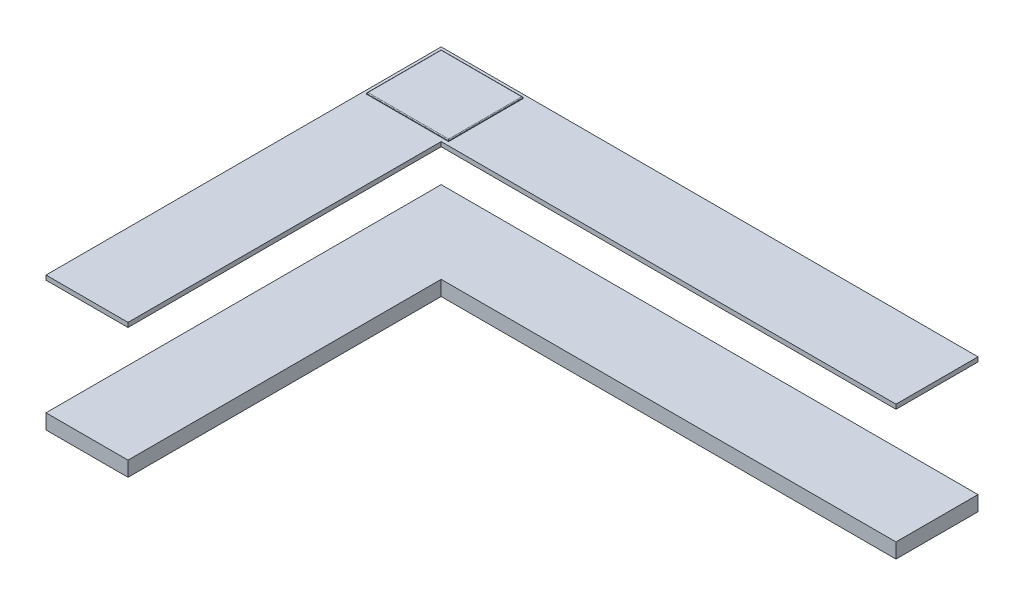
ISO-10303-21;
HEADER;
FILE_DESCRIPTION(('STEP AP214'),'2;1');
FILE_NAME('part.step','',(''),(''),'','','');
FILE_SCHEMA(('AUTOMOTIVE_DESIGN { 1 0 10303 214 1 1 1 1 }'));
ENDSEC;
DATA;
#1=APPLICATION_CONTEXT('core data for automotive mechanical design processes');
#2=APPLICATION_PROTOCOL_DEFINITION('international standard','automotive_design',2000,#1);
#3=PRODUCT_CONTEXT('',#1,'mechanical');
#4=PRODUCT('Part','Part','',(#3));
#5=PRODUCT_RELATED_PRODUCT_CATEGORY('part','',(#4));
#6=PRODUCT_DEFINITION_FORMATION('','',#4);
#7=PRODUCT_DEFINITION_CONTEXT('part definition',#1,'design');
#8=PRODUCT_DEFINITION('design','',#6,#7);
#9=PRODUCT_DEFINITION_SHAPE('','',#8);
#10=(LENGTH_UNIT() NAMED_UNIT(*) SI_UNIT(.MILLI.,.METRE.));
#11=(NAMED_UNIT(*) PLANE_ANGLE_UNIT() SI_UNIT($,.RADIAN.));
#12=(NAMED_UNIT(*) SI_UNIT($,.STERADIAN.) SOLID_ANGLE_UNIT());
#13=UNCERTAINTY_MEASURE_WITH_UNIT(LENGTH_MEASURE(1.E-05),#10,'distance_accuracy_value','');
#14=(GEOMETRIC_REPRESENTATION_CONTEXT(3) GLOBAL_UNCERTAINTY_ASSIGNED_CONTEXT((#13)) GLOBAL_UNIT_ASSIGNED_CONTEXT((#10,
#11,#12)) REPRESENTATION_CONTEXT('',''));
#15=CARTESIAN_POINT('',(0.,0.,0.));
#16=DIRECTION('',(0.,0.,1.));
#17=DIRECTION('',(1.,0.,0.));
#18=AXIS2_PLACEMENT_3D('',#15,#16,#17);
#19=CARTESIAN_POINT('',(0.,900.,0.));
#20=DIRECTION('',(0.,1.,0.));
#21=DIRECTION('',(0.,0.,1.));
#22=AXIS2_PLACEMENT_3D('',#19,#20,#21);
#23=PLANE('',#22);
#24=DIRECTION('',(0.,0.,-1.));
#25=VECTOR('',#24,1.);
#26=CARTESIAN_POINT('',(-911.305732484077,900.,1241.12247402156));
#27=LINE('',#26,#25);
#28=CARTESIAN_POINT('',(-911.305732484077,900.,1242.12247402156));
#29=VERTEX_POINT('',#28);
#30=CARTESIAN_POINT('',(-911.305732484077,900.,1241.12247402156));
#31=VERTEX_POINT('',#30);
#32=EDGE_CURVE('E230',#29,#31,#27,.T.);
#33=ORIENTED_EDGE('',*,*,#32,.F.);
#34=DIRECTION('',(1.,0.,0.));
#35=VECTOR('',#34,1.);
#36=CARTESIAN_POINT('',(-911.305732484077,900.,1242.12247402156));
#37=LINE('',#36,#35);
#38=CARTESIAN_POINT('',(-912.305732484077,900.,1242.12247402156));
#39=VERTEX_POINT('',#38);
#40=EDGE_CURVE('E220',#39,#29,#37,.T.);
#41=ORIENTED_EDGE('',*,*,#40,.F.);
#42=DIRECTION('',(0.,0.,1.));
#43=VECTOR('',#42,1.);
#44=CARTESIAN_POINT('',(-912.305732484077,900.,1241.12247402156));
#45=LINE('',#44,#43);
#46=CARTESIAN_POINT('',(-912.305732484077,900.,1241.12247402156));
#47=VERTEX_POINT('',#46);
#48=EDGE_CURVE('E236',#47,#39,#45,.T.);
#49=ORIENTED_EDGE('',*,*,#48,.F.);
#50=DIRECTION('',(-1.,0.,0.));
#51=VECTOR('',#50,1.);
#52=CARTESIAN_POINT('',(-911.305732484077,900.,1241.12247402156));
#53=LINE('',#52,#51);
#54=EDGE_CURVE('E232',#31,#47,#53,.T.);
#55=ORIENTED_EDGE('',*,*,#54,.F.);
#56=EDGE_LOOP('',(#33,#41,#49,#55));
#57=FACE_BOUND('',#56,.T.);
#58=DIRECTION('',(0.,0.,-1.));
#59=VECTOR('',#58,1.);
#60=CARTESIAN_POINT('',(1763.69426751592,900.,-383.877525978437));
#61=LINE('',#60,#59);
#62=CARTESIAN_POINT('',(1763.69426751592,900.,-382.877525978437));
#63=VERTEX_POINT('',#62);
#64=CARTESIAN_POINT('',(1763.69426751592,900.,-383.877525978437));
#65=VERTEX_POINT('',#64);
#66=EDGE_CURVE('E233',#63,#65,#61,.T.);
#67=ORIENTED_EDGE('',*,*,#66,.F.);
#68=DIRECTION('',(1.,0.,0.));
#69=VECTOR('',#68,1.);
#70=CARTESIAN_POINT('',(1763.69426751592,900.,-382.877525978437));
#71=LINE('',#70,#69);
#72=CARTESIAN_POINT('',(1762.69426751592,900.,-382.877525978437));
#73=VERTEX_POINT('',#72);
#74=EDGE_CURVE('E259',#73,#63,#71,.T.);
#75=ORIENTED_EDGE('',*,*,#74,.F.);
#76=DIRECTION('',(0.,0.,1.));
#77=VECTOR('',#76,1.);
#78=CARTESIAN_POINT('',(1762.69426751592,900.,-383.877525978437));
#79=LINE('',#78,#77);
#80=CARTESIAN_POINT('',(1762.69426751592,900.,-383.877525978437));
#81=VERTEX_POINT('',#80);
#82=EDGE_CURVE('E262',#81,#73,#79,.T.);
#83=ORIENTED_EDGE('',*,*,#82,.F.);
#84=DIRECTION('',(-1.,0.,0.));
#85=VECTOR('',#84,1.);
#86=CARTESIAN_POINT('',(1763.69426751592,900.,-383.877525978437));
#87=LINE('',#86,#85);
#88=EDGE_CURVE('E266',#65,#81,#87,.T.);
#89=ORIENTED_EDGE('',*,*,#88,.F.);
#90=EDGE_LOOP('',(#67,#75,#83,#89));
#91=FACE_BOUND('',#90,.T.);
#92=DIRECTION('',(1.,0.,0.));
#93=VECTOR('',#92,1.);
#94=CARTESIAN_POINT('',(2163.69426751592,900.,-357.877525978438));
#95=LINE('',#94,#93);
#96=CARTESIAN_POINT('',(-886.305732484077,900.,-357.877525978437));
#97=VERTEX_POINT('',#96);
#98=CARTESIAN_POINT('',(2163.69426751592,900.,-357.877525978438));
#99=VERTEX_POINT('',#98);
#100=EDGE_CURVE('E280',#97,#99,#95,.T.);
#101=ORIENTED_EDGE('',*,*,#100,.T.);
#102=DIRECTION('',(0.,0.,-1.));
#103=VECTOR('',#102,1.);
#104=CARTESIAN_POINT('',(2163.69426751592,900.,-907.877525978437));
#105=LINE('',#104,#103);
#106=CARTESIAN_POINT('',(2163.69426751592,900.,-907.877525978437));
#107=VERTEX_POINT('',#106);
#108=EDGE_CURVE('E283',#99,#107,#105,.T.);
#109=ORIENTED_EDGE('',*,*,#108,.T.);
#110=DIRECTION('',(-1.,0.,0.));
#111=VECTOR('',#110,1.);
#112=CARTESIAN_POINT('',(-1436.30573248408,900.,-907.877525978437));
#113=LINE('',#112,#111);
#114=CARTESIAN_POINT('',(-1436.30573248408,900.,-907.877525978437));
#115=VERTEX_POINT('',#114);
#116=EDGE_CURVE('E286',#107,#115,#113,.T.);
#117=ORIENTED_EDGE('',*,*,#116,.T.);
#118=DIRECTION('',(0.,0.,1.));
#119=VECTOR('',#118,1.);
#120=CARTESIAN_POINT('',(-1436.30573248408,900.,1742.12247402156));
#121=LINE('',#120,#119);
#122=CARTESIAN_POINT('',(-1436.30573248408,900.,1742.12247402156));
#123=VERTEX_POINT('',#122);
#124=EDGE_CURVE('E288',#115,#123,#121,.T.);
#125=ORIENTED_EDGE('',*,*,#124,.T.);
#126=DIRECTION('',(1.,0.,0.));
#127=VECTOR('',#126,1.);
#128=CARTESIAN_POINT('',(-886.305732484077,900.,1742.12247402156));
#129=LINE('',#128,#127);
#130=CARTESIAN_POINT('',(-886.305732484077,900.,1742.12247402156));
#131=VERTEX_POINT('',#130);
#132=EDGE_CURVE('E290',#123,#131,#129,.T.);
#133=ORIENTED_EDGE('',*,*,#132,.T.);
#134=DIRECTION('',(0.,0.,-1.));
#135=VECTOR('',#134,1.);
#136=CARTESIAN_POINT('',(-886.305732484077,900.,-357.877525978437));
#137=LINE('',#136,#135);
#138=EDGE_CURVE('E292',#131,#97,#137,.T.);
#139=ORIENTED_EDGE('',*,*,#138,.T.);
#140=EDGE_LOOP('',(#101,#109,#117,#125,#133,#139));
#141=FACE_BOUND('',#140,.T.);
#142=DIRECTION('',(1.,0.,0.));
#143=VECTOR('',#142,1.);
#144=CARTESIAN_POINT('',(-1411.30573248408,900.,-382.877525978438));
#145=LINE('',#144,#143);
#146=CARTESIAN_POINT('',(-1411.30573248408,900.,-382.877525978438));
#147=VERTEX_POINT('',#146);
#148=CARTESIAN_POINT('',(-861.305732484078,900.,-382.877525978438));
#149=VERTEX_POINT('',#148);
#150=EDGE_CURVE('E189',#147,#149,#145,.T.);
#151=ORIENTED_EDGE('',*,*,#150,.F.);
#152=DIRECTION('',(0.,0.,1.));
#153=VECTOR('',#152,1.);
#154=CARTESIAN_POINT('',(-1411.30573248408,900.,-882.877525978437));
#155=LINE('',#154,#153);
#156=CARTESIAN_POINT('',(-1411.30573248408,900.,-882.877525978437));
#157=VERTEX_POINT('',#156);
#158=EDGE_CURVE('E197',#157,#147,#155,.T.);
#159=ORIENTED_EDGE('',*,*,#158,.F.);
#160=DIRECTION('',(-1.,0.,0.));
#161=VECTOR('',#160,1.);
#162=CARTESIAN_POINT('',(-1411.30573248408,900.,-882.877525978437));
#163=LINE('',#162,#161);
#164=CARTESIAN_POINT('',(-861.305732484078,900.,-882.877525978437));
#165=VERTEX_POINT('',#164);
#166=EDGE_CURVE('E208',#165,#157,#163,.T.);
#167=ORIENTED_EDGE('',*,*,#166,.F.);
#168=DIRECTION('',(0.,0.,-1.));
#169=VECTOR('',#168,1.);
#170=CARTESIAN_POINT('',(-861.305732484078,900.,-882.877525978437));
#171=LINE('',#170,#169);
#172=EDGE_CURVE('E206',#149,#165,#171,.T.);
#173=ORIENTED_EDGE('',*,*,#172,.F.);
#174=EDGE_LOOP('',(#151,#159,#167,#173));
#175=FACE_BOUND('',#174,.T.);
#176=ADVANCED_FACE('F49',(#57,#91,#141,#175),#23,.T.);
#177=CARTESIAN_POINT('',(2163.69426751592,900.,-357.877525978438));
#178=DIRECTION('',(0.,0.,-1.));
#179=DIRECTION('',(-1.,0.,0.));
#180=AXIS2_PLACEMENT_3D('',#177,#178,#179);
#181=PLANE('',#180);
#182=DIRECTION('',(1.,0.,0.));
#183=VECTOR('',#182,1.);
#184=CARTESIAN_POINT('',(2163.69426751592,870.,-357.877525978438));
#185=LINE('',#184,#183);
#186=CARTESIAN_POINT('',(-886.305732484077,870.,-357.877525978437));
#187=VERTEX_POINT('',#186);
#188=CARTESIAN_POINT('',(2163.69426751592,870.,-357.877525978438));
#189=VERTEX_POINT('',#188);
#190=EDGE_CURVE('E243',#187,#189,#185,.T.);
#191=ORIENTED_EDGE('',*,*,#190,.T.);
#192=DIRECTION('',(0.,-1.,0.));
#193=VECTOR('',#192,1.);
#194=CARTESIAN_POINT('',(2163.69426751592,900.,-357.877525978438));
#195=LINE('',#194,#193);
#196=EDGE_CURVE('E320',#99,#189,#195,.T.);
#197=ORIENTED_EDGE('',*,*,#196,.F.);
#198=ORIENTED_EDGE('',*,*,#100,.F.);
#199=DIRECTION('',(0.,-1.,0.));
#200=VECTOR('',#199,1.);
#201=CARTESIAN_POINT('',(-886.305732484077,900.,-357.877525978437));
#202=LINE('',#201,#200);
#203=EDGE_CURVE('E294',#97,#187,#202,.T.);
#204=ORIENTED_EDGE('',*,*,#203,.T.);
#205=EDGE_LOOP('',(#191,#197,#198,#204));
#206=FACE_BOUND('',#205,.T.);
#207=ADVANCED_FACE('F372',(#206),#181,.F.);
#208=CARTESIAN_POINT('',(2163.69426751592,900.,-907.877525978437));
#209=DIRECTION('',(-1.,0.,0.));
#210=DIRECTION('',(0.,0.,1.));
#211=AXIS2_PLACEMENT_3D('',#208,#209,#210);
#212=PLANE('',#211);
#213=DIRECTION('',(0.,0.,-1.));
#214=VECTOR('',#213,1.);
#215=CARTESIAN_POINT('',(2163.69426751592,870.,-907.877525978437));
#216=LINE('',#215,#214);
#217=CARTESIAN_POINT('',(2163.69426751592,870.,-907.877525978437));
#218=VERTEX_POINT('',#217);
#219=EDGE_CURVE('E297',#189,#218,#216,.T.);
#220=ORIENTED_EDGE('',*,*,#219,.T.);
#221=DIRECTION('',(0.,-1.,0.));
#222=VECTOR('',#221,1.);
#223=CARTESIAN_POINT('',(2163.69426751592,900.,-907.877525978437));
#224=LINE('',#223,#222);
#225=EDGE_CURVE('E317',#107,#218,#224,.T.);
#226=ORIENTED_EDGE('',*,*,#225,.F.);
#227=ORIENTED_EDGE('',*,*,#108,.F.);
#228=ORIENTED_EDGE('',*,*,#196,.T.);
#229=EDGE_LOOP('',(#220,#226,#227,#228));
#230=FACE_BOUND('',#229,.T.);
#231=ADVANCED_FACE('F378',(#230),#212,.F.);
#232=CARTESIAN_POINT('',(-1436.30573248408,900.,-907.877525978437));
#233=DIRECTION('',(0.,0.,1.));
#234=DIRECTION('',(1.,0.,0.));
#235=AXIS2_PLACEMENT_3D('',#232,#233,#234);
#236=PLANE('',#235);
#237=DIRECTION('',(-1.,0.,0.));
#238=VECTOR('',#237,1.);
#239=CARTESIAN_POINT('',(-1436.30573248408,870.,-907.877525978437));
#240=LINE('',#239,#238);
#241=CARTESIAN_POINT('',(-1436.30573248408,870.,-907.877525978437));
#242=VERTEX_POINT('',#241);
#243=EDGE_CURVE('E299',#218,#242,#240,.T.);
#244=ORIENTED_EDGE('',*,*,#243,.T.);
#245=DIRECTION('',(0.,-1.,0.));
#246=VECTOR('',#245,1.);
#247=CARTESIAN_POINT('',(-1436.30573248408,900.,-907.877525978437));
#248=LINE('',#247,#246);
#249=EDGE_CURVE('E314',#115,#242,#248,.T.);
#250=ORIENTED_EDGE('',*,*,#249,.F.);
#251=ORIENTED_EDGE('',*,*,#116,.F.);
#252=ORIENTED_EDGE('',*,*,#225,.T.);
#253=EDGE_LOOP('',(#244,#250,#251,#252));
#254=FACE_BOUND('',#253,.T.);
#255=ADVANCED_FACE('F403',(#254),#236,.F.);
#256=CARTESIAN_POINT('',(-1436.30573248408,900.,1742.12247402156));
#257=DIRECTION('',(1.,0.,0.));
#258=DIRECTION('',(0.,0.,-1.));
#259=AXIS2_PLACEMENT_3D('',#256,#257,#258);
#260=PLANE('',#259);
#261=DIRECTION('',(0.,0.,1.));
#262=VECTOR('',#261,1.);
#263=CARTESIAN_POINT('',(-1436.30573248408,870.,1742.12247402156));
#264=LINE('',#263,#262);
#265=CARTESIAN_POINT('',(-1436.30573248408,870.,1742.12247402156));
#266=VERTEX_POINT('',#265);
#267=EDGE_CURVE('E301',#242,#266,#264,.T.);
#268=ORIENTED_EDGE('',*,*,#267,.T.);
#269=DIRECTION('',(0.,-1.,0.));
#270=VECTOR('',#269,1.);
#271=CARTESIAN_POINT('',(-1436.30573248408,900.,1742.12247402156));
#272=LINE('',#271,#270);
#273=EDGE_CURVE('E311',#123,#266,#272,.T.);
#274=ORIENTED_EDGE('',*,*,#273,.F.);
#275=ORIENTED_EDGE('',*,*,#124,.F.);
#276=ORIENTED_EDGE('',*,*,#249,.T.);
#277=EDGE_LOOP('',(#268,#274,#275,#276));
#278=FACE_BOUND('',#277,.T.);
#279=ADVANCED_FACE('F399',(#278),#260,.F.);
#280=CARTESIAN_POINT('',(-886.305732484077,900.,1742.12247402156));
#281=DIRECTION('',(0.,0.,-1.));
#282=DIRECTION('',(-1.,0.,0.));
#283=AXIS2_PLACEMENT_3D('',#280,#281,#282);
#284=PLANE('',#283);
#285=DIRECTION('',(1.,0.,0.));
#286=VECTOR('',#285,1.);
#287=CARTESIAN_POINT('',(-886.305732484077,870.,1742.12247402156));
#288=LINE('',#287,#286);
#289=CARTESIAN_POINT('',(-886.305732484077,870.,1742.12247402156));
#290=VERTEX_POINT('',#289);
#291=EDGE_CURVE('E303',#266,#290,#288,.T.);
#292=ORIENTED_EDGE('',*,*,#291,.T.);
#293=DIRECTION('',(0.,-1.,0.));
#294=VECTOR('',#293,1.);
#295=CARTESIAN_POINT('',(-886.305732484077,900.,1742.12247402156));
#296=LINE('',#295,#294);
#297=EDGE_CURVE('E308',#131,#290,#296,.T.);
#298=ORIENTED_EDGE('',*,*,#297,.F.);
#299=ORIENTED_EDGE('',*,*,#132,.F.);
#300=ORIENTED_EDGE('',*,*,#273,.T.);
#301=EDGE_LOOP('',(#292,#298,#299,#300));
#302=FACE_BOUND('',#301,.T.);
#303=ADVANCED_FACE('F395',(#302),#284,.F.);
#304=CARTESIAN_POINT('',(-886.305732484077,900.,-357.877525978437));
#305=DIRECTION('',(-1.,0.,0.));
#306=DIRECTION('',(0.,0.,1.));
#307=AXIS2_PLACEMENT_3D('',#304,#305,#306);
#308=PLANE('',#307);
#309=DIRECTION('',(0.,0.,-1.));
#310=VECTOR('',#309,1.);
#311=CARTESIAN_POINT('',(-886.305732484077,870.,-357.877525978437));
#312=LINE('',#311,#310);
#313=EDGE_CURVE('E284',#290,#187,#312,.T.);
#314=ORIENTED_EDGE('',*,*,#313,.T.);
#315=ORIENTED_EDGE('',*,*,#203,.F.);
#316=ORIENTED_EDGE('',*,*,#138,.F.);
#317=ORIENTED_EDGE('',*,*,#297,.T.);
#318=EDGE_LOOP('',(#314,#315,#316,#317));
#319=FACE_BOUND('',#318,.T.);
#320=ADVANCED_FACE('F391',(#319),#308,.F.);
#321=CARTESIAN_POINT('',(0.,870.,0.));
#322=DIRECTION('',(0.,1.,0.));
#323=DIRECTION('',(0.,0.,1.));
#324=AXIS2_PLACEMENT_3D('',#321,#322,#323);
#325=PLANE('',#324);
#326=DIRECTION('',(1.,0.,0.));
#327=VECTOR('',#326,1.);
#328=CARTESIAN_POINT('',(-911.305732484077,870.,1242.12247402156));
#329=LINE('',#328,#327);
#330=CARTESIAN_POINT('',(-912.305732484077,870.,1242.12247402156));
#331=VERTEX_POINT('',#330);
#332=CARTESIAN_POINT('',(-911.305732484077,870.,1242.12247402156));
#333=VERTEX_POINT('',#332);
#334=EDGE_CURVE('E226',#331,#333,#329,.T.);
#335=ORIENTED_EDGE('',*,*,#334,.T.);
#336=DIRECTION('',(0.,0.,-1.));
#337=VECTOR('',#336,1.);
#338=CARTESIAN_POINT('',(-911.305732484077,870.,1241.12247402156));
#339=LINE('',#338,#337);
#340=CARTESIAN_POINT('',(-911.305732484077,870.,1241.12247402156));
#341=VERTEX_POINT('',#340);
#342=EDGE_CURVE('E216',#333,#341,#339,.T.);
#343=ORIENTED_EDGE('',*,*,#342,.T.);
#344=DIRECTION('',(-1.,0.,0.));
#345=VECTOR('',#344,1.);
#346=CARTESIAN_POINT('',(-911.305732484077,870.,1241.12247402156));
#347=LINE('',#346,#345);
#348=CARTESIAN_POINT('',(-912.305732484077,870.,1241.12247402156));
#349=VERTEX_POINT('',#348);
#350=EDGE_CURVE('E219',#341,#349,#347,.T.);
#351=ORIENTED_EDGE('',*,*,#350,.T.);
#352=DIRECTION('',(0.,0.,1.));
#353=VECTOR('',#352,1.);
#354=CARTESIAN_POINT('',(-912.305732484077,870.,1241.12247402156));
#355=LINE('',#354,#353);
#356=EDGE_CURVE('E223',#349,#331,#355,.T.);
#357=ORIENTED_EDGE('',*,*,#356,.T.);
#358=EDGE_LOOP('',(#335,#343,#351,#357));
#359=FACE_BOUND('',#358,.T.);
#360=DIRECTION('',(1.,0.,0.));
#361=VECTOR('',#360,1.);
#362=CARTESIAN_POINT('',(1763.69426751592,870.,-382.877525978437));
#363=LINE('',#362,#361);
#364=CARTESIAN_POINT('',(1762.69426751592,870.,-382.877525978437));
#365=VERTEX_POINT('',#364);
#366=CARTESIAN_POINT('',(1763.69426751592,870.,-382.877525978437));
#367=VERTEX_POINT('',#366);
#368=EDGE_CURVE('E253',#365,#367,#363,.T.);
#369=ORIENTED_EDGE('',*,*,#368,.T.);
#370=DIRECTION('',(0.,0.,-1.));
#371=VECTOR('',#370,1.);
#372=CARTESIAN_POINT('',(1763.69426751592,870.,-383.877525978437));
#373=LINE('',#372,#371);
#374=CARTESIAN_POINT('',(1763.69426751592,870.,-383.877525978437));
#375=VERTEX_POINT('',#374);
#376=EDGE_CURVE('E263',#367,#375,#373,.T.);
#377=ORIENTED_EDGE('',*,*,#376,.T.);
#378=DIRECTION('',(-1.,0.,0.));
#379=VECTOR('',#378,1.);
#380=CARTESIAN_POINT('',(1763.69426751592,870.,-383.877525978437));
#381=LINE('',#380,#379);
#382=CARTESIAN_POINT('',(1762.69426751592,870.,-383.877525978437));
#383=VERTEX_POINT('',#382);
#384=EDGE_CURVE('E275',#375,#383,#381,.T.);
#385=ORIENTED_EDGE('',*,*,#384,.T.);
#386=DIRECTION('',(0.,0.,1.));
#387=VECTOR('',#386,1.);
#388=CARTESIAN_POINT('',(1762.69426751592,870.,-383.877525978437));
#389=LINE('',#388,#387);
#390=EDGE_CURVE('E272',#383,#365,#389,.T.);
#391=ORIENTED_EDGE('',*,*,#390,.T.);
#392=EDGE_LOOP('',(#369,#377,#385,#391));
#393=FACE_BOUND('',#392,.T.);
#394=ORIENTED_EDGE('',*,*,#190,.F.);
#395=ORIENTED_EDGE('',*,*,#313,.F.);
#396=ORIENTED_EDGE('',*,*,#291,.F.);
#397=ORIENTED_EDGE('',*,*,#267,.F.);
#398=ORIENTED_EDGE('',*,*,#243,.F.);
#399=ORIENTED_EDGE('',*,*,#219,.F.);
#400=EDGE_LOOP('',(#394,#395,#396,#397,#398,#399));
#401=FACE_BOUND('',#400,.T.);
#402=ADVANCED_FACE('F387',(#359,#393,#401),#325,.F.);
#403=CARTESIAN_POINT('',(1763.69426751592,870.,-383.877525978437));
#404=DIRECTION('',(1.,0.,0.));
#405=DIRECTION('',(0.,0.,-1.));
#406=AXIS2_PLACEMENT_3D('',#403,#404,#405);
#407=PLANE('',#406);
#408=ORIENTED_EDGE('',*,*,#66,.T.);
#409=DIRECTION('',(0.,1.,0.));
#410=VECTOR('',#409,1.);
#411=CARTESIAN_POINT('',(1763.69426751592,870.,-383.877525978437));
#412=LINE('',#411,#410);
#413=EDGE_CURVE('E250',#375,#65,#412,.T.);
#414=ORIENTED_EDGE('',*,*,#413,.F.);
#415=ORIENTED_EDGE('',*,*,#376,.F.);
#416=DIRECTION('',(0.,1.,0.));
#417=VECTOR('',#416,1.);
#418=CARTESIAN_POINT('',(1763.69426751592,870.,-382.877525978437));
#419=LINE('',#418,#417);
#420=EDGE_CURVE('E193',#367,#63,#419,.T.);
#421=ORIENTED_EDGE('',*,*,#420,.T.);
#422=EDGE_LOOP('',(#408,#414,#415,#421));
#423=FACE_BOUND('',#422,.T.);
#424=ADVANCED_FACE('F390',(#423),#407,.F.);
#425=CARTESIAN_POINT('',(1763.69426751592,870.,-382.877525978437));
#426=DIRECTION('',(0.,0.,1.));
#427=DIRECTION('',(1.,0.,0.));
#428=AXIS2_PLACEMENT_3D('',#425,#426,#427);
#429=PLANE('',#428);
#430=ORIENTED_EDGE('',*,*,#74,.T.);
#431=ORIENTED_EDGE('',*,*,#420,.F.);
#432=ORIENTED_EDGE('',*,*,#368,.F.);
#433=DIRECTION('',(0.,1.,0.));
#434=VECTOR('',#433,1.);
#435=CARTESIAN_POINT('',(1762.69426751592,870.,-382.877525978437));
#436=LINE('',#435,#434);
#437=EDGE_CURVE('E256',#365,#73,#436,.T.);
#438=ORIENTED_EDGE('',*,*,#437,.T.);
#439=EDGE_LOOP('',(#430,#431,#432,#438));
#440=FACE_BOUND('',#439,.T.);
#441=ADVANCED_FACE('F385',(#440),#429,.F.);
#442=CARTESIAN_POINT('',(1762.69426751592,870.,-383.877525978437));
#443=DIRECTION('',(-1.,0.,0.));
#444=DIRECTION('',(0.,0.,1.));
#445=AXIS2_PLACEMENT_3D('',#442,#443,#444);
#446=PLANE('',#445);
#447=ORIENTED_EDGE('',*,*,#82,.T.);
#448=ORIENTED_EDGE('',*,*,#437,.F.);
#449=ORIENTED_EDGE('',*,*,#390,.F.);
#450=DIRECTION('',(0.,1.,0.));
#451=VECTOR('',#450,1.);
#452=CARTESIAN_POINT('',(1762.69426751592,870.,-383.877525978437));
#453=LINE('',#452,#451);
#454=EDGE_CURVE('E254',#383,#81,#453,.T.);
#455=ORIENTED_EDGE('',*,*,#454,.T.);
#456=EDGE_LOOP('',(#447,#448,#449,#455));
#457=FACE_BOUND('',#456,.T.);
#458=ADVANCED_FACE('F544',(#457),#446,.F.);
#459=CARTESIAN_POINT('',(1763.69426751592,870.,-383.877525978437));
#460=DIRECTION('',(0.,0.,-1.));
#461=DIRECTION('',(-1.,0.,0.));
#462=AXIS2_PLACEMENT_3D('',#459,#460,#461);
#463=PLANE('',#462);
#464=ORIENTED_EDGE('',*,*,#88,.T.);
#465=ORIENTED_EDGE('',*,*,#454,.F.);
#466=ORIENTED_EDGE('',*,*,#384,.F.);
#467=ORIENTED_EDGE('',*,*,#413,.T.);
#468=EDGE_LOOP('',(#464,#465,#466,#467));
#469=FACE_BOUND('',#468,.T.);
#470=ADVANCED_FACE('F533',(#469),#463,.F.);
#471=CARTESIAN_POINT('',(-911.305732484077,870.,1241.12247402156));
#472=DIRECTION('',(1.,0.,0.));
#473=DIRECTION('',(0.,0.,-1.));
#474=AXIS2_PLACEMENT_3D('',#471,#472,#473);
#475=PLANE('',#474);
#476=ORIENTED_EDGE('',*,*,#32,.T.);
#477=DIRECTION('',(0.,1.,0.));
#478=VECTOR('',#477,1.);
#479=CARTESIAN_POINT('',(-911.305732484077,870.,1241.12247402156));
#480=LINE('',#479,#478);
#481=EDGE_CURVE('E229',#341,#31,#480,.T.);
#482=ORIENTED_EDGE('',*,*,#481,.F.);
#483=ORIENTED_EDGE('',*,*,#342,.F.);
#484=DIRECTION('',(0.,1.,0.));
#485=VECTOR('',#484,1.);
#486=CARTESIAN_POINT('',(-911.305732484077,870.,1242.12247402156));
#487=LINE('',#486,#485);
#488=EDGE_CURVE('E241',#333,#29,#487,.T.);
#489=ORIENTED_EDGE('',*,*,#488,.T.);
#490=EDGE_LOOP('',(#476,#482,#483,#489));
#491=FACE_BOUND('',#490,.T.);
#492=ADVANCED_FACE('F522',(#491),#475,.F.);
#493=CARTESIAN_POINT('',(-911.305732484077,870.,1242.12247402156));
#494=DIRECTION('',(0.,0.,1.));
#495=DIRECTION('',(1.,0.,0.));
#496=AXIS2_PLACEMENT_3D('',#493,#494,#495);
#497=PLANE('',#496);
#498=ORIENTED_EDGE('',*,*,#40,.T.);
#499=ORIENTED_EDGE('',*,*,#488,.F.);
#500=ORIENTED_EDGE('',*,*,#334,.F.);
#501=DIRECTION('',(0.,1.,0.));
#502=VECTOR('',#501,1.);
#503=CARTESIAN_POINT('',(-912.305732484077,870.,1242.12247402156));
#504=LINE('',#503,#502);
#505=EDGE_CURVE('E244',#331,#39,#504,.T.);
#506=ORIENTED_EDGE('',*,*,#505,.T.);
#507=EDGE_LOOP('',(#498,#499,#500,#506));
#508=FACE_BOUND('',#507,.T.);
#509=ADVANCED_FACE('F511',(#508),#497,.F.);
#510=CARTESIAN_POINT('',(-912.305732484077,870.,1241.12247402156));
#511=DIRECTION('',(-1.,0.,0.));
#512=DIRECTION('',(0.,0.,1.));
#513=AXIS2_PLACEMENT_3D('',#510,#511,#512);
#514=PLANE('',#513);
#515=ORIENTED_EDGE('',*,*,#48,.T.);
#516=ORIENTED_EDGE('',*,*,#505,.F.);
#517=ORIENTED_EDGE('',*,*,#356,.F.);
#518=DIRECTION('',(0.,1.,0.));
#519=VECTOR('',#518,1.);
#520=CARTESIAN_POINT('',(-912.305732484077,870.,1241.12247402156));
#521=LINE('',#520,#519);
#522=EDGE_CURVE('E246',#349,#47,#521,.T.);
#523=ORIENTED_EDGE('',*,*,#522,.T.);
#524=EDGE_LOOP('',(#515,#516,#517,#523));
#525=FACE_BOUND('',#524,.T.);
#526=ADVANCED_FACE('F500',(#525),#514,.F.);
#527=CARTESIAN_POINT('',(-911.305732484077,870.,1241.12247402156));
#528=DIRECTION('',(0.,0.,-1.));
#529=DIRECTION('',(-1.,0.,0.));
#530=AXIS2_PLACEMENT_3D('',#527,#528,#529);
#531=PLANE('',#530);
#532=ORIENTED_EDGE('',*,*,#54,.T.);
#533=ORIENTED_EDGE('',*,*,#522,.F.);
#534=ORIENTED_EDGE('',*,*,#350,.F.);
#535=ORIENTED_EDGE('',*,*,#481,.T.);
#536=EDGE_LOOP('',(#532,#533,#534,#535));
#537=FACE_BOUND('',#536,.T.);
#538=ADVANCED_FACE('F485',(#537),#531,.F.);
#539=CARTESIAN_POINT('',(-1411.30573248408,910.,-882.877525978437));
#540=DIRECTION('',(1.,0.,0.));
#541=DIRECTION('',(0.,0.,-1.));
#542=AXIS2_PLACEMENT_3D('',#539,#540,#541);
#543=PLANE('',#542);
#544=DIRECTION('',(0.,-1.,0.));
#545=VECTOR('',#544,1.);
#546=CARTESIAN_POINT('',(-1411.30573248408,910.,-382.877525978438));
#547=LINE('',#546,#545);
#548=CARTESIAN_POINT('',(-1411.30573248408,905.,-382.877525978438));
#549=VERTEX_POINT('',#548);
#550=EDGE_CURVE('E185',#549,#147,#547,.T.);
#551=ORIENTED_EDGE('',*,*,#550,.F.);
#552=DIRECTION('',(0.,0.,1.));
#553=VECTOR('',#552,1.);
#554=CARTESIAN_POINT('',(-1411.30573248408,905.,-882.877525978437));
#555=LINE('',#554,#553);
#556=CARTESIAN_POINT('',(-1411.30573248408,905.,-882.877525978437));
#557=VERTEX_POINT('',#556);
#558=EDGE_CURVE('E12',#549,#557,#555,.F.);
#559=ORIENTED_EDGE('',*,*,#558,.T.);
#560=DIRECTION('',(0.,-1.,0.));
#561=VECTOR('',#560,1.);
#562=CARTESIAN_POINT('',(-1411.30573248408,910.,-882.877525978437));
#563=LINE('',#562,#561);
#564=EDGE_CURVE('E200',#557,#157,#563,.T.);
#565=ORIENTED_EDGE('',*,*,#564,.T.);
#566=ORIENTED_EDGE('',*,*,#158,.T.);
#567=EDGE_LOOP('',(#551,#559,#565,#566));
#568=FACE_BOUND('',#567,.T.);
#569=ADVANCED_FACE('F198',(#568),#543,.F.);
#570=CARTESIAN_POINT('',(-1411.30573248408,910.,-382.877525978438));
#571=DIRECTION('',(0.,0.,-1.));
#572=DIRECTION('',(-1.,0.,0.));
#573=AXIS2_PLACEMENT_3D('',#570,#571,#572);
#574=PLANE('',#573);
#575=DIRECTION('',(0.,-1.,0.));
#576=VECTOR('',#575,1.);
#577=CARTESIAN_POINT('',(-861.305732484078,910.,-382.877525978438));
#578=LINE('',#577,#576);
#579=CARTESIAN_POINT('',(-861.305732484078,905.,-382.877525978438));
#580=VERTEX_POINT('',#579);
#581=EDGE_CURVE('E194',#580,#149,#578,.T.);
#582=ORIENTED_EDGE('',*,*,#581,.F.);
#583=DIRECTION('',(1.,0.,0.));
#584=VECTOR('',#583,1.);
#585=CARTESIAN_POINT('',(-1411.30573248408,905.,-382.877525978438));
#586=LINE('',#585,#584);
#587=EDGE_CURVE('E58',#580,#549,#586,.F.);
#588=ORIENTED_EDGE('',*,*,#587,.T.);
#589=ORIENTED_EDGE('',*,*,#550,.T.);
#590=ORIENTED_EDGE('',*,*,#150,.T.);
#591=EDGE_LOOP('',(#582,#588,#589,#590));
#592=FACE_BOUND('',#591,.T.);
#593=ADVANCED_FACE('F187',(#592),#574,.F.);
#594=CARTESIAN_POINT('',(-861.305732484078,910.,-882.877525978437));
#595=DIRECTION('',(-1.,0.,0.));
#596=DIRECTION('',(0.,0.,1.));
#597=AXIS2_PLACEMENT_3D('',#594,#595,#596);
#598=PLANE('',#597);
#599=DIRECTION('',(0.,-1.,0.));
#600=VECTOR('',#599,1.);
#601=CARTESIAN_POINT('',(-861.305732484078,910.,-882.877525978437));
#602=LINE('',#601,#600);
#603=CARTESIAN_POINT('',(-861.305732484078,905.,-882.877525978437));
#604=VERTEX_POINT('',#603);
#605=EDGE_CURVE('E213',#604,#165,#602,.T.);
#606=ORIENTED_EDGE('',*,*,#605,.F.);
#607=DIRECTION('',(0.,0.,-1.));
#608=VECTOR('',#607,1.);
#609=CARTESIAN_POINT('',(-861.305732484078,905.,-382.877525978438));
#610=LINE('',#609,#608);
#611=EDGE_CURVE('E73',#604,#580,#610,.F.);
#612=ORIENTED_EDGE('',*,*,#611,.T.);
#613=ORIENTED_EDGE('',*,*,#581,.T.);
#614=ORIENTED_EDGE('',*,*,#172,.T.);
#615=EDGE_LOOP('',(#606,#612,#613,#614));
#616=FACE_BOUND('',#615,.T.);
#617=ADVANCED_FACE('F369',(#616),#598,.F.);
#618=CARTESIAN_POINT('',(-1411.30573248408,910.,-882.877525978437));
#619=DIRECTION('',(0.,0.,1.));
#620=DIRECTION('',(1.,0.,0.));
#621=AXIS2_PLACEMENT_3D('',#618,#619,#620);
#622=PLANE('',#621);
#623=ORIENTED_EDGE('',*,*,#564,.F.);
#624=DIRECTION('',(-1.,0.,0.));
#625=VECTOR('',#624,1.);
#626=CARTESIAN_POINT('',(-861.305732484078,905.,-882.877525978437));
#627=LINE('',#626,#625);
#628=EDGE_CURVE('E332',#557,#604,#627,.F.);
#629=ORIENTED_EDGE('',*,*,#628,.T.);
#630=ORIENTED_EDGE('',*,*,#605,.T.);
#631=ORIENTED_EDGE('',*,*,#166,.T.);
#632=EDGE_LOOP('',(#623,#629,#630,#631));
#633=FACE_BOUND('',#632,.T.);
#634=ADVANCED_FACE('F357',(#633),#622,.F.);
#635=CARTESIAN_POINT('',(0.,910.,0.));
#636=DIRECTION('',(0.,1.,0.));
#637=DIRECTION('',(0.,0.,1.));
#638=AXIS2_PLACEMENT_3D('',#635,#636,#637);
#639=PLANE('',#638);
#640=DIRECTION('',(0.,0.,-1.));
#641=VECTOR('',#640,1.);
#642=CARTESIAN_POINT('',(-866.305732484078,910.,-882.877525978437));
#643=LINE('',#642,#641);
#644=CARTESIAN_POINT('',(-866.305732484078,910.,-387.877525978438));
#645=VERTEX_POINT('',#644);
#646=CARTESIAN_POINT('',(-866.305732484078,910.,-877.877525978437));
#647=VERTEX_POINT('',#646);
#648=EDGE_CURVE('E327',#645,#647,#643,.T.);
#649=ORIENTED_EDGE('',*,*,#648,.T.);
#650=DIRECTION('',(-1.,0.,0.));
#651=VECTOR('',#650,1.);
#652=CARTESIAN_POINT('',(-1411.30573248408,910.,-877.877525978437));
#653=LINE('',#652,#651);
#654=CARTESIAN_POINT('',(-1406.30573248408,910.,-877.877525978437));
#655=VERTEX_POINT('',#654);
#656=EDGE_CURVE('E329',#647,#655,#653,.T.);
#657=ORIENTED_EDGE('',*,*,#656,.T.);
#658=DIRECTION('',(0.,0.,1.));
#659=VECTOR('',#658,1.);
#660=CARTESIAN_POINT('',(-1406.30573248408,910.,-382.877525978438));
#661=LINE('',#660,#659);
#662=CARTESIAN_POINT('',(-1406.30573248408,910.,-387.877525978438));
#663=VERTEX_POINT('',#662);
#664=EDGE_CURVE('E323',#655,#663,#661,.T.);
#665=ORIENTED_EDGE('',*,*,#664,.T.);
#666=DIRECTION('',(1.,0.,0.));
#667=VECTOR('',#666,1.);
#668=CARTESIAN_POINT('',(-861.305732484078,910.,-387.877525978438));
#669=LINE('',#668,#667);
#670=EDGE_CURVE('E325',#663,#645,#669,.T.);
#671=ORIENTED_EDGE('',*,*,#670,.T.);
#672=EDGE_LOOP('',(#649,#657,#665,#671));
#673=FACE_BOUND('',#672,.T.);
#674=ADVANCED_FACE('F362',(#673),#639,.T.);
#675=CARTESIAN_POINT('',(0.,905.,-387.877525978438));
#676=DIRECTION('',(-1.,0.,0.));
#677=DIRECTION('',(0.,0.,1.));
#678=AXIS2_PLACEMENT_3D('',#675,#676,#677);
#679=CYLINDRICAL_SURFACE('',#678,5.);
#680=CARTESIAN_POINT('',(-1406.30573248408,905.,-387.877525978438));
#681=DIRECTION('',(-0.707106781186548,0.,-0.707106781186547));
#682=DIRECTION('',(0.707106781186547,0.,-0.707106781186548));
#683=AXIS2_PLACEMENT_3D('',#680,#681,#682);
#684=ELLIPSE('',#683,7.07106781186547,5.);
#685=EDGE_CURVE('E340',#549,#663,#684,.T.);
#686=ORIENTED_EDGE('',*,*,#685,.F.);
#687=ORIENTED_EDGE('',*,*,#587,.F.);
#688=CARTESIAN_POINT('',(-866.305732484078,905.,-387.877525978438));
#689=DIRECTION('',(-0.707106781186547,0.,0.707106781186547));
#690=DIRECTION('',(-0.707106781186547,0.,-0.707106781186547));
#691=AXIS2_PLACEMENT_3D('',#688,#689,#690);
#692=ELLIPSE('',#691,7.07106781186547,5.);
#693=EDGE_CURVE('E53',#645,#580,#692,.F.);
#694=ORIENTED_EDGE('',*,*,#693,.F.);
#695=ORIENTED_EDGE('',*,*,#670,.F.);
#696=EDGE_LOOP('',(#686,#687,#694,#695));
#697=FACE_BOUND('',#696,.T.);
#698=ADVANCED_FACE('F51',(#697),#679,.T.);
#699=CARTESIAN_POINT('',(-866.305732484078,905.,0.));
#700=DIRECTION('',(0.,0.,1.));
#701=DIRECTION('',(1.,0.,0.));
#702=AXIS2_PLACEMENT_3D('',#699,#700,#701);
#703=CYLINDRICAL_SURFACE('',#702,5.);
#704=ORIENTED_EDGE('',*,*,#693,.T.);
#705=ORIENTED_EDGE('',*,*,#611,.F.);
#706=CARTESIAN_POINT('',(-866.305732484078,905.,-877.877525978437));
#707=DIRECTION('',(0.707106781186547,0.,0.707106781186547));
#708=DIRECTION('',(-0.707106781186547,0.,0.707106781186547));
#709=AXIS2_PLACEMENT_3D('',#706,#707,#708);
#710=ELLIPSE('',#709,7.07106781186547,5.);
#711=EDGE_CURVE('E339',#647,#604,#710,.F.);
#712=ORIENTED_EDGE('',*,*,#711,.F.);
#713=ORIENTED_EDGE('',*,*,#648,.F.);
#714=EDGE_LOOP('',(#704,#705,#712,#713));
#715=FACE_BOUND('',#714,.T.);
#716=ADVANCED_FACE('F349',(#715),#703,.T.);
#717=CARTESIAN_POINT('',(-1406.30573248408,905.,6.24525201546467E-13));
#718=DIRECTION('',(0.,0.,-1.));
#719=DIRECTION('',(-1.,0.,0.));
#720=AXIS2_PLACEMENT_3D('',#717,#718,#719);
#721=CYLINDRICAL_SURFACE('',#720,5.);
#722=ORIENTED_EDGE('',*,*,#685,.T.);
#723=ORIENTED_EDGE('',*,*,#664,.F.);
#724=CARTESIAN_POINT('',(-1406.30573248408,905.,-877.877525978437));
#725=DIRECTION('',(0.707106781186547,0.,-0.707106781186548));
#726=DIRECTION('',(-0.707106781186548,0.,-0.707106781186547));
#727=AXIS2_PLACEMENT_3D('',#724,#725,#726);
#728=ELLIPSE('',#727,7.07106781186548,5.);
#729=EDGE_CURVE('E337',#557,#655,#728,.T.);
#730=ORIENTED_EDGE('',*,*,#729,.F.);
#731=ORIENTED_EDGE('',*,*,#558,.F.);
#732=EDGE_LOOP('',(#722,#723,#730,#731));
#733=FACE_BOUND('',#732,.T.);
#734=ADVANCED_FACE('F354',(#733),#721,.T.);
#735=CARTESIAN_POINT('',(0.,905.,-877.877525978437));
#736=DIRECTION('',(1.,0.,0.));
#737=DIRECTION('',(0.,0.,-1.));
#738=AXIS2_PLACEMENT_3D('',#735,#736,#737);
#739=CYLINDRICAL_SURFACE('',#738,5.);
#740=ORIENTED_EDGE('',*,*,#711,.T.);
#741=ORIENTED_EDGE('',*,*,#628,.F.);
#742=ORIENTED_EDGE('',*,*,#729,.T.);
#743=ORIENTED_EDGE('',*,*,#656,.F.);
#744=EDGE_LOOP('',(#740,#741,#742,#743));
#745=FACE_BOUND('',#744,.T.);
#746=ADVANCED_FACE('F359',(#745),#739,.T.);
#747=CLOSED_SHELL('',(#176,#207,#231,#255,#279,#303,#320,#402,#424,#441,#458,#470,#492,#509,
#526,#538,#569,#593,#617,#634,#674,#698,#716,#734,#746));
#748=MANIFOLD_SOLID_BREP('B2',#747);
#749=CARTESIAN_POINT('',(2163.69426751592,100.,-907.877525978437));
#750=DIRECTION('',(-1.,0.,0.));
#751=DIRECTION('',(0.,0.,1.));
#752=AXIS2_PLACEMENT_3D('',#749,#750,#751);
#753=PLANE('',#752);
#754=DIRECTION('',(0.,0.,-1.));
#755=VECTOR('',#754,1.);
#756=CARTESIAN_POINT('',(2163.69426751592,0.,-907.877525978437));
#757=LINE('',#756,#755);
#758=CARTESIAN_POINT('',(2163.69426751592,0.,-357.877525978437));
#759=VERTEX_POINT('',#758);
#760=CARTESIAN_POINT('',(2163.69426751592,0.,-907.877525978437));
#761=VERTEX_POINT('',#760);
#762=EDGE_CURVE('E766',#759,#761,#757,.T.);
#763=ORIENTED_EDGE('',*,*,#762,.T.);
#764=DIRECTION('',(0.,-1.,0.));
#765=VECTOR('',#764,1.);
#766=CARTESIAN_POINT('',(2163.69426751592,100.,-907.877525978437));
#767=LINE('',#766,#765);
#768=CARTESIAN_POINT('',(2163.69426751592,100.,-907.877525978437));
#769=VERTEX_POINT('',#768);
#770=EDGE_CURVE('E47',#769,#761,#767,.T.);
#771=ORIENTED_EDGE('',*,*,#770,.F.);
#772=DIRECTION('',(0.,0.,-1.));
#773=VECTOR('',#772,1.);
#774=CARTESIAN_POINT('',(2163.69426751592,100.,-907.877525978437));
#775=LINE('',#774,#773);
#776=CARTESIAN_POINT('',(2163.69426751592,100.,-357.877525978437));
#777=VERTEX_POINT('',#776);
#778=EDGE_CURVE('E776',#777,#769,#775,.T.);
#779=ORIENTED_EDGE('',*,*,#778,.F.);
#780=DIRECTION('',(0.,-1.,0.));
#781=VECTOR('',#780,1.);
#782=CARTESIAN_POINT('',(2163.69426751592,100.,-357.877525978437));
#783=LINE('',#782,#781);
#784=EDGE_CURVE('E762',#777,#759,#783,.T.);
#785=ORIENTED_EDGE('',*,*,#784,.T.);
#786=EDGE_LOOP('',(#763,#771,#779,#785));
#787=FACE_BOUND('',#786,.T.);
#788=ADVANCED_FACE('F682',(#787),#753,.F.);
#789=CARTESIAN_POINT('',(2163.69426751592,100.,-907.877525978437));
#790=DIRECTION('',(0.,0.,1.));
#791=DIRECTION('',(1.,0.,0.));
#792=AXIS2_PLACEMENT_3D('',#789,#790,#791);
#793=PLANE('',#792);
#794=DIRECTION('',(-1.,0.,0.));
#795=VECTOR('',#794,1.);
#796=CARTESIAN_POINT('',(2163.69426751592,0.,-907.877525978437));
#797=LINE('',#796,#795);
#798=CARTESIAN_POINT('',(-1436.30573248408,0.,-907.877525978437));
#799=VERTEX_POINT('',#798);
#800=EDGE_CURVE('E769',#761,#799,#797,.T.);
#801=ORIENTED_EDGE('',*,*,#800,.T.);
#802=DIRECTION('',(0.,-1.,0.));
#803=VECTOR('',#802,1.);
#804=CARTESIAN_POINT('',(-1436.30573248408,100.,-907.877525978437));
#805=LINE('',#804,#803);
#806=CARTESIAN_POINT('',(-1436.30573248408,100.,-907.877525978437));
#807=VERTEX_POINT('',#806);
#808=EDGE_CURVE('E690',#807,#799,#805,.T.);
#809=ORIENTED_EDGE('',*,*,#808,.F.);
#810=DIRECTION('',(-1.,0.,0.));
#811=VECTOR('',#810,1.);
#812=CARTESIAN_POINT('',(2163.69426751592,100.,-907.877525978437));
#813=LINE('',#812,#811);
#814=EDGE_CURVE('E735',#769,#807,#813,.T.);
#815=ORIENTED_EDGE('',*,*,#814,.F.);
#816=ORIENTED_EDGE('',*,*,#770,.T.);
#817=EDGE_LOOP('',(#801,#809,#815,#816));
#818=FACE_BOUND('',#817,.T.);
#819=ADVANCED_FACE('F800',(#818),#793,.F.);
#820=CARTESIAN_POINT('',(-1436.30573248408,100.,-907.877525978437));
#821=DIRECTION('',(1.,0.,0.));
#822=DIRECTION('',(0.,0.,-1.));
#823=AXIS2_PLACEMENT_3D('',#820,#821,#822);
#824=PLANE('',#823);
#825=DIRECTION('',(0.,0.,1.));
#826=VECTOR('',#825,1.);
#827=CARTESIAN_POINT('',(-1436.30573248408,0.,-907.877525978437));
#828=LINE('',#827,#826);
#829=CARTESIAN_POINT('',(-1436.30573248408,0.,1742.12247402156));
#830=VERTEX_POINT('',#829);
#831=EDGE_CURVE('E771',#799,#830,#828,.T.);
#832=ORIENTED_EDGE('',*,*,#831,.T.);
#833=DIRECTION('',(0.,-1.,0.));
#834=VECTOR('',#833,1.);
#835=CARTESIAN_POINT('',(-1436.30573248408,100.,1742.12247402156));
#836=LINE('',#835,#834);
#837=CARTESIAN_POINT('',(-1436.30573248408,100.,1742.12247402156));
#838=VERTEX_POINT('',#837);
#839=EDGE_CURVE('E757',#838,#830,#836,.T.);
#840=ORIENTED_EDGE('',*,*,#839,.F.);
#841=DIRECTION('',(0.,0.,1.));
#842=VECTOR('',#841,1.);
#843=CARTESIAN_POINT('',(-1436.30573248408,100.,-907.877525978437));
#844=LINE('',#843,#842);
#845=EDGE_CURVE('E748',#807,#838,#844,.T.);
#846=ORIENTED_EDGE('',*,*,#845,.F.);
#847=ORIENTED_EDGE('',*,*,#808,.T.);
#848=EDGE_LOOP('',(#832,#840,#846,#847));
#849=FACE_BOUND('',#848,.T.);
#850=ADVANCED_FACE('F782',(#849),#824,.F.);
#851=CARTESIAN_POINT('',(-886.305732484077,100.,1742.12247402156));
#852=DIRECTION('',(0.,0.,-1.));
#853=DIRECTION('',(-1.,0.,0.));
#854=AXIS2_PLACEMENT_3D('',#851,#852,#853);
#855=PLANE('',#854);
#856=DIRECTION('',(1.,0.,0.));
#857=VECTOR('',#856,1.);
#858=CARTESIAN_POINT('',(-886.305732484077,0.,1742.12247402156));
#859=LINE('',#858,#857);
#860=CARTESIAN_POINT('',(-886.305732484077,0.,1742.12247402156));
#861=VERTEX_POINT('',#860);
#862=EDGE_CURVE('E756',#830,#861,#859,.T.);
#863=ORIENTED_EDGE('',*,*,#862,.T.);
#864=DIRECTION('',(0.,-1.,0.));
#865=VECTOR('',#864,1.);
#866=CARTESIAN_POINT('',(-886.305732484077,100.,1742.12247402156));
#867=LINE('',#866,#865);
#868=CARTESIAN_POINT('',(-886.305732484077,100.,1742.12247402156));
#869=VERTEX_POINT('',#868);
#870=EDGE_CURVE('E753',#869,#861,#867,.T.);
#871=ORIENTED_EDGE('',*,*,#870,.F.);
#872=DIRECTION('',(1.,0.,0.));
#873=VECTOR('',#872,1.);
#874=CARTESIAN_POINT('',(-886.305732484077,100.,1742.12247402156));
#875=LINE('',#874,#873);
#876=EDGE_CURVE('E742',#838,#869,#875,.T.);
#877=ORIENTED_EDGE('',*,*,#876,.F.);
#878=ORIENTED_EDGE('',*,*,#839,.T.);
#879=EDGE_LOOP('',(#863,#871,#877,#878));
#880=FACE_BOUND('',#879,.T.);
#881=ADVANCED_FACE('F754',(#880),#855,.F.);
#882=CARTESIAN_POINT('',(-886.305732484077,100.,1742.12247402156));
#883=DIRECTION('',(-1.,0.,0.));
#884=DIRECTION('',(0.,0.,1.));
#885=AXIS2_PLACEMENT_3D('',#882,#883,#884);
#886=PLANE('',#885);
#887=DIRECTION('',(0.,0.,-1.));
#888=VECTOR('',#887,1.);
#889=CARTESIAN_POINT('',(-886.305732484077,0.,1742.12247402156));
#890=LINE('',#889,#888);
#891=CARTESIAN_POINT('',(-886.305732484077,0.,-357.877525978437));
#892=VERTEX_POINT('',#891);
#893=EDGE_CURVE('E721',#861,#892,#890,.T.);
#894=ORIENTED_EDGE('',*,*,#893,.T.);
#895=DIRECTION('',(0.,-1.,0.));
#896=VECTOR('',#895,1.);
#897=CARTESIAN_POINT('',(-886.305732484077,100.,-357.877525978437));
#898=LINE('',#897,#896);
#899=CARTESIAN_POINT('',(-886.305732484077,100.,-357.877525978437));
#900=VERTEX_POINT('',#899);
#901=EDGE_CURVE('E758',#900,#892,#898,.T.);
#902=ORIENTED_EDGE('',*,*,#901,.F.);
#903=DIRECTION('',(0.,0.,-1.));
#904=VECTOR('',#903,1.);
#905=CARTESIAN_POINT('',(-886.305732484077,100.,1742.12247402156));
#906=LINE('',#905,#904);
#907=EDGE_CURVE('E746',#869,#900,#906,.T.);
#908=ORIENTED_EDGE('',*,*,#907,.F.);
#909=ORIENTED_EDGE('',*,*,#870,.T.);
#910=EDGE_LOOP('',(#894,#902,#908,#909));
#911=FACE_BOUND('',#910,.T.);
#912=ADVANCED_FACE('F760',(#911),#886,.F.);
#913=CARTESIAN_POINT('',(-886.305732484077,100.,-357.877525978437));
#914=DIRECTION('',(0.,0.,-1.));
#915=DIRECTION('',(-1.,0.,0.));
#916=AXIS2_PLACEMENT_3D('',#913,#914,#915);
#917=PLANE('',#916);
#918=DIRECTION('',(1.,0.,0.));
#919=VECTOR('',#918,1.);
#920=CARTESIAN_POINT('',(-886.305732484077,0.,-357.877525978437));
#921=LINE('',#920,#919);
#922=EDGE_CURVE('E727',#892,#759,#921,.T.);
#923=ORIENTED_EDGE('',*,*,#922,.T.);
#924=ORIENTED_EDGE('',*,*,#784,.F.);
#925=DIRECTION('',(1.,0.,0.));
#926=VECTOR('',#925,1.);
#927=CARTESIAN_POINT('',(-886.305732484077,100.,-357.877525978437));
#928=LINE('',#927,#926);
#929=EDGE_CURVE('E698',#900,#777,#928,.T.);
#930=ORIENTED_EDGE('',*,*,#929,.F.);
#931=ORIENTED_EDGE('',*,*,#901,.T.);
#932=EDGE_LOOP('',(#923,#924,#930,#931));
#933=FACE_BOUND('',#932,.T.);
#934=ADVANCED_FACE('F789',(#933),#917,.F.);
#935=CARTESIAN_POINT('',(0.,100.,0.));
#936=DIRECTION('',(0.,1.,0.));
#937=DIRECTION('',(0.,0.,1.));
#938=AXIS2_PLACEMENT_3D('',#935,#936,#937);
#939=PLANE('',#938);
#940=ORIENTED_EDGE('',*,*,#778,.T.);
#941=ORIENTED_EDGE('',*,*,#814,.T.);
#942=ORIENTED_EDGE('',*,*,#845,.T.);
#943=ORIENTED_EDGE('',*,*,#876,.T.);
#944=ORIENTED_EDGE('',*,*,#907,.T.);
#945=ORIENTED_EDGE('',*,*,#929,.T.);
#946=EDGE_LOOP('',(#940,#941,#942,#943,#944,#945));
#947=FACE_BOUND('',#946,.T.);
#948=ADVANCED_FACE('F744',(#947),#939,.T.);
#949=CARTESIAN_POINT('',(0.,0.,0.));
#950=DIRECTION('',(0.,1.,0.));
#951=DIRECTION('',(0.,0.,1.));
#952=AXIS2_PLACEMENT_3D('',#949,#950,#951);
#953=PLANE('',#952);
#954=ORIENTED_EDGE('',*,*,#762,.F.);
#955=ORIENTED_EDGE('',*,*,#922,.F.);
#956=ORIENTED_EDGE('',*,*,#893,.F.);
#957=ORIENTED_EDGE('',*,*,#862,.F.);
#958=ORIENTED_EDGE('',*,*,#831,.F.);
#959=ORIENTED_EDGE('',*,*,#800,.F.);
#960=EDGE_LOOP('',(#954,#955,#956,#957,#958,#959));
#961=FACE_BOUND('',#960,.T.);
#962=ADVANCED_FACE('F785',(#961),#953,.F.);
#963=CLOSED_SHELL('',(#788,#819,#850,#881,#912,#934,#948,#962));
#964=MANIFOLD_SOLID_BREP('B6',#963);
#965=ADVANCED_BREP_SHAPE_REPRESENTATION('',(#18,#748,#964),#14);
#966=SHAPE_DEFINITION_REPRESENTATION(#9,#965);
ENDSEC;
END-ISO-10303-21;
